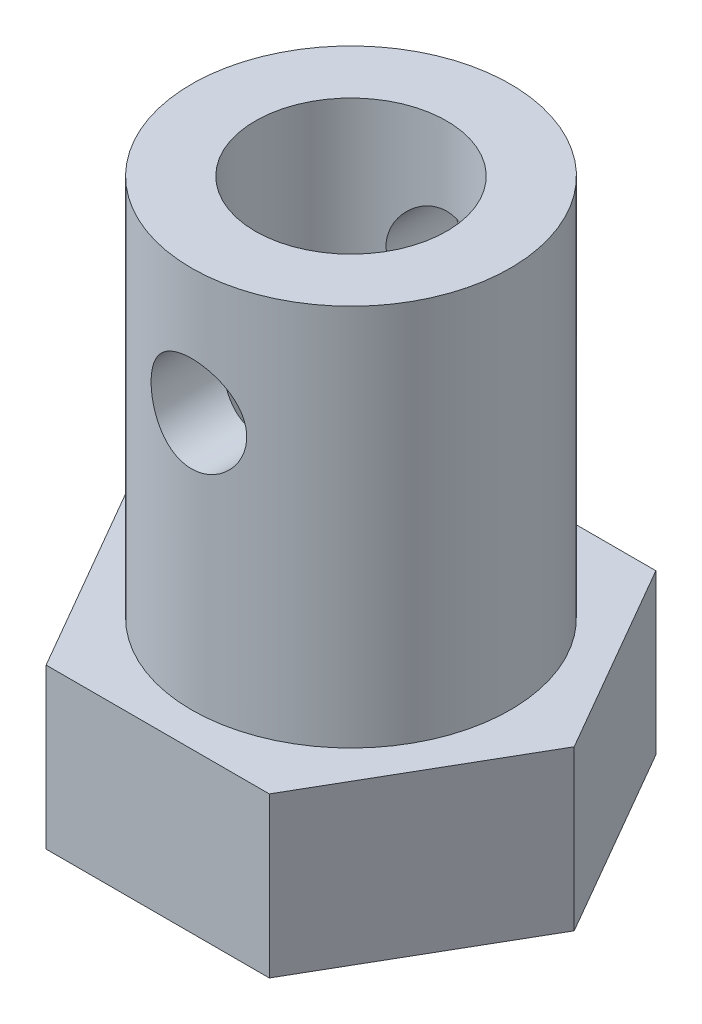
ISO-10303-21;
HEADER;
FILE_DESCRIPTION(('STEP AP214'),'2;1');
FILE_NAME('part.step','',(''),(''),'','','');
FILE_SCHEMA(('AUTOMOTIVE_DESIGN { 1 0 10303 214 1 1 1 1 }'));
ENDSEC;
DATA;
#1=APPLICATION_CONTEXT('core data for automotive mechanical design processes');
#2=APPLICATION_PROTOCOL_DEFINITION('international standard','automotive_design',2000,#1);
#3=PRODUCT_CONTEXT('',#1,'mechanical');
#4=PRODUCT('Part','Part','',(#3));
#5=PRODUCT_RELATED_PRODUCT_CATEGORY('part','',(#4));
#6=PRODUCT_DEFINITION_FORMATION('','',#4);
#7=PRODUCT_DEFINITION_CONTEXT('part definition',#1,'design');
#8=PRODUCT_DEFINITION('design','',#6,#7);
#9=PRODUCT_DEFINITION_SHAPE('','',#8);
#10=(LENGTH_UNIT() NAMED_UNIT(*) SI_UNIT(.MILLI.,.METRE.));
#11=(NAMED_UNIT(*) PLANE_ANGLE_UNIT() SI_UNIT($,.RADIAN.));
#12=(NAMED_UNIT(*) SI_UNIT($,.STERADIAN.) SOLID_ANGLE_UNIT());
#13=UNCERTAINTY_MEASURE_WITH_UNIT(LENGTH_MEASURE(1.E-05),#10,'distance_accuracy_value','');
#14=(GEOMETRIC_REPRESENTATION_CONTEXT(3) GLOBAL_UNCERTAINTY_ASSIGNED_CONTEXT((#13)) GLOBAL_UNIT_ASSIGNED_CONTEXT((#10,
#11,#12)) REPRESENTATION_CONTEXT('',''));
#15=CARTESIAN_POINT('',(0.,0.,0.));
#16=DIRECTION('',(0.,0.,1.));
#17=DIRECTION('',(1.,0.,0.));
#18=AXIS2_PLACEMENT_3D('',#15,#16,#17);
#19=CARTESIAN_POINT('',(0.,17.,0.));
#20=DIRECTION('',(0.,-1.,0.));
#21=DIRECTION('',(0.,0.,-1.));
#22=AXIS2_PLACEMENT_3D('',#19,#20,#21);
#23=CYLINDRICAL_SURFACE('',#22,5.);
#24=CARTESIAN_POINT('',(0.,5.,0.));
#25=DIRECTION('',(0.,1.,0.));
#26=DIRECTION('',(0.,0.,1.));
#27=AXIS2_PLACEMENT_3D('',#24,#25,#26);
#28=CIRCLE('',#27,5.);
#29=CARTESIAN_POINT('',(0.,5.,5.));
#30=VERTEX_POINT('',#29);
#31=EDGE_CURVE('E141',#30,#30,#28,.F.);
#32=ORIENTED_EDGE('',*,*,#31,.F.);
#33=EDGE_LOOP('',(#32));
#34=FACE_BOUND('',#33,.T.);
#35=CARTESIAN_POINT('',(0.,17.,0.));
#36=DIRECTION('',(0.,1.,0.));
#37=DIRECTION('',(0.,0.,1.));
#38=AXIS2_PLACEMENT_3D('',#35,#36,#37);
#39=CIRCLE('',#38,5.);
#40=CARTESIAN_POINT('',(0.,17.,5.));
#41=VERTEX_POINT('',#40);
#42=EDGE_CURVE('E236',#41,#41,#39,.T.);
#43=ORIENTED_EDGE('',*,*,#42,.F.);
#44=EDGE_LOOP('',(#43));
#45=FACE_BOUND('',#44,.T.);
#46=CARTESIAN_POINT('',(0.,14.5474637879701,-5.));
#47=CARTESIAN_POINT('',(0.0822886127533,14.5474627904852,-4.9999992925055));
#48=CARTESIAN_POINT('',(0.164587318351529,14.5406699243462,-4.99794915693954));
#49=CARTESIAN_POINT('',(0.326788125304881,14.513742433748,-4.98997105593691));
#50=CARTESIAN_POINT('',(0.40668950441142,14.4936038299468,-4.98404193389692));
#51=CARTESIAN_POINT('',(0.561732707754526,14.4407177710599,-4.96895552501836));
#52=CARTESIAN_POINT('',(0.636881364395373,14.4079889183512,-4.95980300250425));
#53=CARTESIAN_POINT('',(0.780624181053131,14.3309276949143,-4.93922109237645));
#54=CARTESIAN_POINT('',(0.849217467469669,14.2865937805747,-4.92779140192067));
#55=CARTESIAN_POINT('',(0.979871797183745,14.1862397804975,-4.90350737192774));
#56=CARTESIAN_POINT('',(1.04171807124434,14.1299471620842,-4.89062383657036));
#57=CARTESIAN_POINT('',(1.15524920923324,14.0078545580599,-4.86505834210442));
#58=CARTESIAN_POINT('',(1.20693236327441,13.9420529758452,-4.85237641724501));
#59=CARTESIAN_POINT('',(1.29980037723708,13.8009930349325,-4.82834113993772));
#60=CARTESIAN_POINT('',(1.34072309022213,13.7255553269794,-4.81702406663875));
#61=CARTESIAN_POINT('',(1.4092139477476,13.5684745337398,-4.79743620394031));
#62=CARTESIAN_POINT('',(1.43678529919973,13.4868329440421,-4.78916468313311));
#63=CARTESIAN_POINT('',(1.47701633682652,13.3220735218397,-4.77690870838434));
#64=CARTESIAN_POINT('',(1.49007196234677,13.2390610441062,-4.77281069324533));
#65=CARTESIAN_POINT('',(1.50213730614672,13.0719306317534,-4.76902789749767));
#66=CARTESIAN_POINT('',(1.50115042761078,12.987812969911,-4.76934204760571));
#67=CARTESIAN_POINT('',(1.48546977199812,12.8240798793616,-4.77424744067778));
#68=CARTESIAN_POINT('',(1.47127205262685,12.7444115376079,-4.7786838859914));
#69=CARTESIAN_POINT('',(1.43037420427056,12.5886440016967,-4.79108356228624));
#70=CARTESIAN_POINT('',(1.40367284141641,12.5125451605958,-4.79904714132351));
#71=CARTESIAN_POINT('',(1.33816026653682,12.3648634383094,-4.81772733074973));
#72=CARTESIAN_POINT('',(1.29918816934643,12.2933567040149,-4.82848016115952));
#73=CARTESIAN_POINT('',(1.21035222588683,12.1577317659599,-4.85150987000064));
#74=CARTESIAN_POINT('',(1.16048574002588,12.0936153585563,-4.86378711746991));
#75=CARTESIAN_POINT('',(1.04881290765546,11.9717775972081,-4.88911011297937));
#76=CARTESIAN_POINT('',(0.986594907466973,11.9144351239405,-4.90216654310498));
#77=CARTESIAN_POINT('',(0.853263259313968,11.8109098039059,-4.92712244063259));
#78=CARTESIAN_POINT('',(0.782149051860889,11.7647276595557,-4.9390218351841));
#79=CARTESIAN_POINT('',(0.632355038342804,11.6846038655054,-4.9604316006947));
#80=CARTESIAN_POINT('',(0.553627749747951,11.6507462717203,-4.96992543668314));
#81=CARTESIAN_POINT('',(0.39124541560352,11.5968641978705,-4.98533521832222));
#82=CARTESIAN_POINT('',(0.307591751589583,11.5768358594376,-4.99125216186999));
#83=CARTESIAN_POINT('',(0.140952242668333,11.5518116100707,-4.99868364643538));
#84=CARTESIAN_POINT('',(0.0580500976011878,11.5463022021685,-5.0003485041779));
#85=CARTESIAN_POINT('',(-0.107499605823382,11.5490329436822,-4.9995292324176));
#86=CARTESIAN_POINT('',(-0.19014719669078,11.5572712576216,-4.99704565677756));
#87=CARTESIAN_POINT('',(-0.350903605309696,11.5868483990816,-4.98830696987163));
#88=CARTESIAN_POINT('',(-0.429072772614168,11.607887175551,-4.98213829799417));
#89=CARTESIAN_POINT('',(-0.580754638954521,11.6621070207483,-4.96674347841533));
#90=CARTESIAN_POINT('',(-0.654266777025583,11.695289549008,-4.95751696321085));
#91=CARTESIAN_POINT('',(-0.796437189461051,11.7737169534513,-4.93669654351325));
#92=CARTESIAN_POINT('',(-0.864943826199669,11.8192231289181,-4.92505280829675));
#93=CARTESIAN_POINT('',(-0.993523307980146,11.9206885420229,-4.90073468764318));
#94=CARTESIAN_POINT('',(-1.05359403235593,11.9766503998578,-4.8880600443108));
#95=CARTESIAN_POINT('',(-1.16585744551027,12.0998510963395,-4.86253171869138));
#96=CARTESIAN_POINT('',(-1.21768481231503,12.1674256637419,-4.84968825033268));
#97=CARTESIAN_POINT('',(-1.30928995072153,12.3105917269837,-4.82576515238463));
#98=CARTESIAN_POINT('',(-1.34906803829472,12.3861830125283,-4.81468547654651));
#99=CARTESIAN_POINT('',(-1.41517347127168,12.5429962792248,-4.79567189615055));
#100=CARTESIAN_POINT('',(-1.4415634693705,12.6241899745067,-4.78772337843827));
#101=CARTESIAN_POINT('',(-1.48021730815114,12.7901517569016,-4.77591594362794));
#102=CARTESIAN_POINT('',(-1.49248598978779,12.8749186087578,-4.772055625083));
#103=CARTESIAN_POINT('',(-1.50221984485059,13.0418253063463,-4.76899972496087));
#104=CARTESIAN_POINT('',(-1.5002805530849,13.1239274389877,-4.76961647442755));
#105=CARTESIAN_POINT('',(-1.48307505444813,13.2865778913429,-4.77499401288294));
#106=CARTESIAN_POINT('',(-1.46780938124716,13.3671262731465,-4.77975463592551));
#107=CARTESIAN_POINT('',(-1.42476888804136,13.523409187113,-4.79275763670385));
#108=CARTESIAN_POINT('',(-1.39715175507068,13.5991910753318,-4.80095604545965));
#109=CARTESIAN_POINT('',(-1.33031507121129,13.7451062267878,-4.81990278909136));
#110=CARTESIAN_POINT('',(-1.29109329962876,13.8152384056109,-4.83065161194312));
#111=CARTESIAN_POINT('',(-1.20048763805072,13.9506269044972,-4.85397676425833));
#112=CARTESIAN_POINT('',(-1.14871276092994,14.0156125492305,-4.86660540163798));
#113=CARTESIAN_POINT('',(-1.03517434629782,14.136166286278,-4.89201320450026));
#114=CARTESIAN_POINT('',(-0.973408217134501,14.1917319274379,-4.90479240823905));
#115=CARTESIAN_POINT('',(-0.839465762183249,14.2934872002652,-4.92950936570649));
#116=CARTESIAN_POINT('',(-0.767037885790609,14.3393552348256,-4.94141159765674));
#117=CARTESIAN_POINT('',(-0.615141373983531,14.4181989578741,-4.96260680455813));
#118=CARTESIAN_POINT('',(-0.535676052998956,14.4511806762446,-4.97190099931067));
#119=CARTESIAN_POINT('',(-0.380757712655282,14.5003590636229,-4.98602174969301));
#120=CARTESIAN_POINT('',(-0.305786961954235,14.5179754608534,-4.99122027381068));
#121=CARTESIAN_POINT('',(-0.153880195230779,14.5415273132117,-4.99820944494492));
#122=CARTESIAN_POINT('',(-0.0769445098581395,14.5474647206749,-5.0000006615474));
#123=CARTESIAN_POINT('',(0.,14.5474637879701,-5.));
#124=B_SPLINE_CURVE_WITH_KNOTS('',3,(#46,#47,#48,#49,#50,#51,#52,#53,#54,#55,#56,#57,#58,#59,
#60,#61,#62,#63,#64,#65,#66,#67,#68,#69,#70,#71,#72,#73,#74,#75,#76,#77,#78,#79,#80,#81,#82,#83,
#84,#85,#86,#87,#88,#89,#90,#91,#92,#93,#94,#95,#96,#97,#98,#99,#100,#101,#102,#103,#104,#105,
#106,#107,#108,#109,#110,#111,#112,#113,#114,#115,#116,#117,#118,#119,#120,#121,#122,#123),
.UNSPECIFIED.,.T.,.F.,(4,2,2,2,2,2,2,2,2,2,2,2,2,2,2,2,2,2,2,2,2,2,2,2,2,2,2,2,2,2,2,2,2,2,2,2,
2,2,4),(0.,0.246583203612611,0.493239964845999,0.739533676300874,0.985860164412702,
1.23855602948191,1.49129437288633,1.74971481004109,2.00807314543223,2.25919689356599,
2.51025978319089,2.75226016697676,2.99428443658001,3.23962426447119,3.48502360158555,
3.74067104048166,3.99633456531071,4.25371046881688,4.51101453528807,4.75908809438545,
5.00712853550326,5.24956746682327,5.49203554593728,5.74011305702908,5.98825282000191,
6.24540400322818,6.5025484425268,6.75847814951251,7.01432009460282,7.25950155466943,
7.504673196616,7.74680040402721,7.98897397553107,8.2399692567993,8.49102974897502,
8.7494299615667,9.00770911595235,9.23831691930459,9.46888616948874),.UNSPECIFIED.);
#125=CARTESIAN_POINT('',(0.,14.5474637879701,-5.));
#126=VERTEX_POINT('',#125);
#127=EDGE_CURVE('E188',#126,#126,#124,.T.);
#128=ORIENTED_EDGE('',*,*,#127,.F.);
#129=EDGE_LOOP('',(#128));
#130=FACE_BOUND('',#129,.T.);
#131=CARTESIAN_POINT('',(0.,11.5474637879701,5.00000000000001));
#132=CARTESIAN_POINT('',(0.0822886127532998,11.547464785455,4.9999992925055));
#133=CARTESIAN_POINT('',(0.164587318351529,11.5542576515941,4.99794915693954));
#134=CARTESIAN_POINT('',(0.32678812530488,11.5811851421922,4.98997105593691));
#135=CARTESIAN_POINT('',(0.406689504411419,11.6013237459935,4.98404193389692));
#136=CARTESIAN_POINT('',(0.561732707754525,11.6542098048804,4.96895552501836));
#137=CARTESIAN_POINT('',(0.636881364395371,11.6869386575891,4.95980300250425));
#138=CARTESIAN_POINT('',(0.780624181053129,11.763999881026,4.93922109237645));
#139=CARTESIAN_POINT('',(0.849217467469667,11.8083337953655,4.92779140192067));
#140=CARTESIAN_POINT('',(0.979871797183744,11.9086877954428,4.90350737192774));
#141=CARTESIAN_POINT('',(1.04171807124434,11.964980413856,4.89062383657036));
#142=CARTESIAN_POINT('',(1.15524920923324,12.0870730178803,4.86505834210442));
#143=CARTESIAN_POINT('',(1.20693236327441,12.1528746000951,4.85237641724501));
#144=CARTESIAN_POINT('',(1.29980037723708,12.2939345410077,4.82834113993772));
#145=CARTESIAN_POINT('',(1.34072309022213,12.3693722489609,4.81702406663875));
#146=CARTESIAN_POINT('',(1.4092139477476,12.5264530422004,4.79743620394031));
#147=CARTESIAN_POINT('',(1.43678529919973,12.6080946318981,4.78916468313311));
#148=CARTESIAN_POINT('',(1.47701633682652,12.7728540541006,4.77690870838434));
#149=CARTESIAN_POINT('',(1.49007196234677,12.8558665318341,4.77281069324533));
#150=CARTESIAN_POINT('',(1.50213730614672,13.0229969441869,4.76902789749767));
#151=CARTESIAN_POINT('',(1.50115042761078,13.1071146060292,4.76934204760571));
#152=CARTESIAN_POINT('',(1.48546977199812,13.2708476965786,4.77424744067778));
#153=CARTESIAN_POINT('',(1.47127205262685,13.3505160383324,4.7786838859914));
#154=CARTESIAN_POINT('',(1.43037420427056,13.5062835742436,4.79108356228624));
#155=CARTESIAN_POINT('',(1.40367284141641,13.5823824153445,4.79904714132351));
#156=CARTESIAN_POINT('',(1.33816026653682,13.7300641376309,4.81772733074973));
#157=CARTESIAN_POINT('',(1.29918816934643,13.8015708719254,4.82848016115952));
#158=CARTESIAN_POINT('',(1.21035222588683,13.9371958099803,4.85150987000064));
#159=CARTESIAN_POINT('',(1.16048574002589,14.0013122173839,4.86378711746991));
#160=CARTESIAN_POINT('',(1.04881290765547,14.1231499787321,4.88911011297937));
#161=CARTESIAN_POINT('',(0.986594907466974,14.1804924519998,4.90216654310498));
#162=CARTESIAN_POINT('',(0.853263259313969,14.2840177720344,4.92712244063258));
#163=CARTESIAN_POINT('',(0.782149051860889,14.3301999163845,4.9390218351841));
#164=CARTESIAN_POINT('',(0.632355038342804,14.4103237104349,4.9604316006947));
#165=CARTESIAN_POINT('',(0.553627749747951,14.44418130422,4.96992543668314));
#166=CARTESIAN_POINT('',(0.391245415603521,14.4980633780698,4.98533521832222));
#167=CARTESIAN_POINT('',(0.307591751589583,14.5180917165026,4.99125216186999));
#168=CARTESIAN_POINT('',(0.140952242668333,14.5431159658695,4.99868364643538));
#169=CARTESIAN_POINT('',(0.0580500976011886,14.5486253737717,5.0003485041779));
#170=CARTESIAN_POINT('',(-0.107499605823381,14.545894632258,4.9995292324176));
#171=CARTESIAN_POINT('',(-0.190147196690779,14.5376563183187,4.99704565677756));
#172=CARTESIAN_POINT('',(-0.350903605309695,14.5080791768586,4.98830696987163));
#173=CARTESIAN_POINT('',(-0.429072772614167,14.4870404003893,4.98213829799417));
#174=CARTESIAN_POINT('',(-0.58075463895452,14.4328205551919,4.96674347841533));
#175=CARTESIAN_POINT('',(-0.654266777025582,14.3996380269323,4.95751696321085));
#176=CARTESIAN_POINT('',(-0.79643718946105,14.321210622489,4.93669654351325));
#177=CARTESIAN_POINT('',(-0.864943826199667,14.2757044470222,4.92505280829675));
#178=CARTESIAN_POINT('',(-0.993523307980145,14.1742390339173,4.90073468764318));
#179=CARTESIAN_POINT('',(-1.05359403235593,14.1182771760825,4.8880600443108));
#180=CARTESIAN_POINT('',(-1.16585744551027,13.9950764796008,4.86253171869138));
#181=CARTESIAN_POINT('',(-1.21768481231503,13.9275019121984,4.84968825033268));
#182=CARTESIAN_POINT('',(-1.30928995072153,13.7843358489566,4.82576515238463));
#183=CARTESIAN_POINT('',(-1.34906803829472,13.7087445634119,4.81468547654651));
#184=CARTESIAN_POINT('',(-1.41517347127168,13.5519312967154,4.79567189615055));
#185=CARTESIAN_POINT('',(-1.4415634693705,13.4707376014335,4.78772337843827));
#186=CARTESIAN_POINT('',(-1.48021730815114,13.3047758190386,4.77591594362794));
#187=CARTESIAN_POINT('',(-1.49248598978779,13.2200089671825,4.772055625083));
#188=CARTESIAN_POINT('',(-1.50221984485059,13.0531022695939,4.76899972496087));
#189=CARTESIAN_POINT('',(-1.5002805530849,12.9710001369525,4.76961647442755));
#190=CARTESIAN_POINT('',(-1.48307505444813,12.8083496845973,4.77499401288294));
#191=CARTESIAN_POINT('',(-1.46780938124716,12.7278013027938,4.77975463592551));
#192=CARTESIAN_POINT('',(-1.42476888804136,12.5715183888273,4.79275763670385));
#193=CARTESIAN_POINT('',(-1.39715175507068,12.4957365006084,4.80095604545965));
#194=CARTESIAN_POINT('',(-1.33031507121129,12.3498213491524,4.81990278909136));
#195=CARTESIAN_POINT('',(-1.29109329962876,12.2796891703294,4.83065161194312));
#196=CARTESIAN_POINT('',(-1.20048763805072,12.144300671443,4.85397676425833));
#197=CARTESIAN_POINT('',(-1.14871276092994,12.0793150267097,4.86660540163798));
#198=CARTESIAN_POINT('',(-1.03517434629782,11.9587612896623,4.89201320450026));
#199=CARTESIAN_POINT('',(-0.973408217134501,11.9031956485024,4.90479240823905));
#200=CARTESIAN_POINT('',(-0.839465762183249,11.8014403756751,4.92950936570649));
#201=CARTESIAN_POINT('',(-0.767037885790609,11.7555723411146,4.94141159765674));
#202=CARTESIAN_POINT('',(-0.615141373983531,11.6767286180661,4.96260680455813));
#203=CARTESIAN_POINT('',(-0.535676052998957,11.6437468996956,4.97190099931067));
#204=CARTESIAN_POINT('',(-0.380757712655282,11.5945685123174,4.98602174969301));
#205=CARTESIAN_POINT('',(-0.305786961954235,11.5769521150869,4.99122027381067));
#206=CARTESIAN_POINT('',(-0.153880195230779,11.5534002627285,4.99820944494492));
#207=CARTESIAN_POINT('',(-0.0769445098581395,11.5474628552653,5.00000066154741));
#208=CARTESIAN_POINT('',(0.,11.5474637879701,5.00000000000001));
#209=B_SPLINE_CURVE_WITH_KNOTS('',3,(#131,#132,#133,#134,#135,#136,#137,#138,#139,#140,#141,
#142,#143,#144,#145,#146,#147,#148,#149,#150,#151,#152,#153,#154,#155,#156,#157,#158,#159,#160,
#161,#162,#163,#164,#165,#166,#167,#168,#169,#170,#171,#172,#173,#174,#175,#176,#177,#178,#179,
#180,#181,#182,#183,#184,#185,#186,#187,#188,#189,#190,#191,#192,#193,#194,#195,#196,#197,#198,
#199,#200,#201,#202,#203,#204,#205,#206,#207,#208),.UNSPECIFIED.,.T.,.F.,(4,2,2,2,2,2,2,2,2,2,2,
2,2,2,2,2,2,2,2,2,2,2,2,2,2,2,2,2,2,2,2,2,2,2,2,2,2,2,4),(0.,0.24658320361261,0.493239964845999,
0.739533676300871,0.9858601644127,1.23855602948191,1.49129437288633,1.74971481004109,
2.00807314543223,2.25919689356599,2.51025978319089,2.75226016697676,2.99428443658001,
3.23962426447119,3.48502360158555,3.74067104048166,3.99633456531071,4.25371046881688,
4.51101453528808,4.75908809438545,5.00712853550327,5.24956746682327,5.49203554593728,
5.74011305702908,5.98825282000191,6.24540400322818,6.5025484425268,6.75847814951252,
7.01432009460283,7.25950155466943,7.504673196616,7.74680040402721,7.98897397553107,
8.23996925679931,8.49102974897502,8.74942996156671,9.00770911595235,9.2383169193046,
9.46888616948875),.UNSPECIFIED.);
#210=CARTESIAN_POINT('',(0.,11.5474637879701,5.00000000000001));
#211=VERTEX_POINT('',#210);
#212=EDGE_CURVE('E181',#211,#211,#209,.T.);
#213=ORIENTED_EDGE('',*,*,#212,.F.);
#214=EDGE_LOOP('',(#213));
#215=FACE_BOUND('',#214,.T.);
#216=ADVANCED_FACE('F39',(#34,#45,#130,#215),#23,.T.);
#217=CARTESIAN_POINT('',(0.,17.,0.));
#218=DIRECTION('',(0.,-1.,0.));
#219=DIRECTION('',(0.,0.,-1.));
#220=AXIS2_PLACEMENT_3D('',#217,#218,#219);
#221=CYLINDRICAL_SURFACE('',#220,3.);
#222=CARTESIAN_POINT('',(-1.5,13.0474637879701,2.59807621135332));
#223=CARTESIAN_POINT('',(-1.4999945446118,12.9693020756772,2.59808302092689));
#224=CARTESIAN_POINT('',(-1.49384995609983,12.8910416706826,2.60165701781635));
#225=CARTESIAN_POINT('',(-1.46958481484708,12.7369228909544,2.61543549678079));
#226=CARTESIAN_POINT('',(-1.45143909683127,12.661069915405,2.62565391083339));
#227=CARTESIAN_POINT('',(-1.40414992304972,12.5142862914542,2.65124019908098));
#228=CARTESIAN_POINT('',(-1.3750649287406,12.4433318092597,2.66658065209878));
#229=CARTESIAN_POINT('',(-1.30690128806456,12.307327484975,2.70063997225287));
#230=CARTESIAN_POINT('',(-1.26782210105366,12.2422779625764,2.71935902214097));
#231=CARTESIAN_POINT('',(-1.17699981079632,12.1140051951339,2.75995303586162));
#232=CARTESIAN_POINT('',(-1.12447805421566,12.0513750844598,2.7819609545693));
#233=CARTESIAN_POINT('',(-1.0098807114217,11.9353512053601,2.82557974178559));
#234=CARTESIAN_POINT('',(-0.94780038867344,11.8819620440948,2.84719040746875));
#235=CARTESIAN_POINT('',(-0.81073434512182,11.7824130612486,2.88932215429424));
#236=CARTESIAN_POINT('',(-0.735160783518864,11.7369831361808,2.90967159627259));
#237=CARTESIAN_POINT('',(-0.576235539899257,11.6597525081015,2.94526134149293));
#238=CARTESIAN_POINT('',(-0.492888807207234,11.6279432037644,2.96050486775612));
#239=CARTESIAN_POINT('',(-0.327067415888967,11.5812067960185,2.98320691866356));
#240=CARTESIAN_POINT('',(-0.244952685733227,11.5652394984368,2.99114220331338));
#241=CARTESIAN_POINT('',(-0.0788559430467731,11.5472146099576,3.00011375769101));
#242=CARTESIAN_POINT('',(0.00512490876560694,11.5451486027766,3.00115420176885));
#243=CARTESIAN_POINT('',(0.164748786635624,11.5545837989256,2.99644472874675));
#244=CARTESIAN_POINT('',(0.240481798765187,11.564920811252,2.99127743838241));
#245=CARTESIAN_POINT('',(0.388970657877483,11.5967850538271,2.97561367889621));
#246=CARTESIAN_POINT('',(0.461726281640888,11.6183131214345,2.96511681099591));
#247=CARTESIAN_POINT('',(0.60346408735433,11.6720876371048,2.93957374931482));
#248=CARTESIAN_POINT('',(0.672380135272767,11.7044782577282,2.92446662293799));
#249=CARTESIAN_POINT('',(0.803965202269993,11.7788589122724,2.89106468980031));
#250=CARTESIAN_POINT('',(0.866631973257968,11.8208523829236,2.87276874236226));
#251=CARTESIAN_POINT('',(0.990260491347292,11.9178068152696,2.83266591598844));
#252=CARTESIAN_POINT('',(1.05050111254404,11.9736183304591,2.81069063997263));
#253=CARTESIAN_POINT('',(1.16115655544667,12.0943483753654,2.76681510880218));
#254=CARTESIAN_POINT('',(1.21156381736135,12.1592738463812,2.74491492398443));
#255=CARTESIAN_POINT('',(1.30425800196332,12.3014360766063,2.70216234138727));
#256=CARTESIAN_POINT('',(1.34582597246708,12.3791928225514,2.68146479986061));
#257=CARTESIAN_POINT('',(1.41497866950185,12.5418702950086,2.64563175417864));
#258=CARTESIAN_POINT('',(1.44257798731633,12.6267834374965,2.63049045069101));
#259=CARTESIAN_POINT('',(1.48077031653756,12.7942855548943,2.60916953725552));
#260=CARTESIAN_POINT('',(1.49253768317996,12.8765254665354,2.60237483772745));
#261=CARTESIAN_POINT('',(1.50227541991714,13.0420658002449,2.59676879042414));
#262=CARTESIAN_POINT('',(1.50025553597254,13.1253654316498,2.59795180333967));
#263=CARTESIAN_POINT('',(1.48355406501595,13.2809446658382,2.60751504810877));
#264=CARTESIAN_POINT('',(1.4702817250687,13.353432964632,2.61509381259981));
#265=CARTESIAN_POINT('',(1.43354442694866,13.4950154673766,2.63541032327012));
#266=CARTESIAN_POINT('',(1.41007616793542,13.56410856409,2.64814974007551));
#267=CARTESIAN_POINT('',(1.35247138290733,13.7005807843242,2.67804333119485));
#268=CARTESIAN_POINT('',(1.31789109553909,13.7677323132505,2.69537464864595));
#269=CARTESIAN_POINT('',(1.23943059602371,13.8956676952786,2.73234179245875));
#270=CARTESIAN_POINT('',(1.19554560649832,13.95644825324,2.75197880032721));
#271=CARTESIAN_POINT('',(1.09325575079828,14.0779319392554,2.79431997684504));
#272=CARTESIAN_POINT('',(1.03371790847245,14.1376595140466,2.81709874731434));
#273=CARTESIAN_POINT('',(0.905106743097433,14.2465821449605,2.86101352466839));
#274=CARTESIAN_POINT('',(0.836030211983021,14.2957736433159,2.88214897511564));
#275=CARTESIAN_POINT('',(0.687803043838137,14.3833243768953,2.92112042536435));
#276=CARTESIAN_POINT('',(0.608434646361171,14.4213634652865,2.93885462508044));
#277=CARTESIAN_POINT('',(0.443283546961624,14.4831706437562,2.96825032438951));
#278=CARTESIAN_POINT('',(0.357506552088265,14.5069512650196,2.97991715514559));
#279=CARTESIAN_POINT('',(0.190469523495627,14.5375166342321,2.99501262272824));
#280=CARTESIAN_POINT('',(0.109517165775687,14.5456606017843,2.99909891862287));
#281=CARTESIAN_POINT('',(-0.0526889789268044,14.5487286861517,3.00063195562697));
#282=CARTESIAN_POINT('',(-0.133942650442629,14.5436574307555,2.99808102100335));
#283=CARTESIAN_POINT('',(-0.28880698847572,14.5213391777767,2.98700953256884));
#284=CARTESIAN_POINT('',(-0.362568476716895,14.5049165140836,2.97889342001985));
#285=CARTESIAN_POINT('',(-0.506168928275426,14.4614732890157,2.95788140495135));
#286=CARTESIAN_POINT('',(-0.576007327433262,14.4344512078299,2.94498481699194));
#287=CARTESIAN_POINT('',(-0.713135109367327,14.3693732097212,2.9148889612218));
#288=CARTESIAN_POINT('',(-0.780187714050069,14.3308948031584,2.89752925798199));
#289=CARTESIAN_POINT('',(-0.907161962721037,14.2445268916815,2.86032199712739));
#290=CARTESIAN_POINT('',(-0.96708031112236,14.1966330642966,2.84047329837541));
#291=CARTESIAN_POINT('',(-1.08437100623534,14.0872680794361,2.79792915339941));
#292=CARTESIAN_POINT('',(-1.14089652680891,14.0249200567543,2.77514698517547));
#293=CARTESIAN_POINT('',(-1.24299493109201,13.8912877062755,2.73094614244279));
#294=CARTESIAN_POINT('',(-1.28855812501509,13.8199955566686,2.70952868642798));
#295=CARTESIAN_POINT('',(-1.36864661967848,13.6675088180987,2.66999407957374));
#296=CARTESIAN_POINT('',(-1.40277759894141,13.586072491277,2.65200261384405));
#297=CARTESIAN_POINT('',(-1.45631806425962,13.4174651814605,2.62299234492527));
#298=CARTESIAN_POINT('',(-1.47577678676302,13.3303144546011,2.61195024221553));
#299=CARTESIAN_POINT('',(-1.49155051179662,13.2097557544921,2.60293908902686));
#300=CARTESIAN_POINT('',(-1.49471415744578,13.1774119463733,2.60112193507728));
#301=CARTESIAN_POINT('',(-1.49894010763494,13.1125390669468,2.59868903831625));
#302=CARTESIAN_POINT('',(-1.50000227159981,13.0800099833913,2.59807337587664));
#303=CARTESIAN_POINT('',(-1.5,13.0474637879701,2.59807621135332));
#304=B_SPLINE_CURVE_WITH_KNOTS('',3,(#222,#223,#224,#225,#226,#227,#228,#229,#230,#231,#232,
#233,#234,#235,#236,#237,#238,#239,#240,#241,#242,#243,#244,#245,#246,#247,#248,#249,#250,#251,
#252,#253,#254,#255,#256,#257,#258,#259,#260,#261,#262,#263,#264,#265,#266,#267,#268,#269,#270,
#271,#272,#273,#274,#275,#276,#277,#278,#279,#280,#281,#282,#283,#284,#285,#286,#287,#288,#289,
#290,#291,#292,#293,#294,#295,#296,#297,#298,#299,#300,#301,#302,#303),.UNSPECIFIED.,.T.,.F.,(4,
2,2,2,2,2,2,2,2,2,2,2,2,2,2,2,2,2,2,2,2,2,2,2,2,2,2,2,2,2,2,2,2,2,2,2,2,2,2,2,4),(0.,
0.234348183892073,0.469189339237207,0.702792893878329,0.936409088167725,1.18929346874735,
1.44230356626556,1.71236838358145,1.98226240445836,2.23295227451903,2.4834903552906,
2.71224146226807,2.94100968776183,3.1729430209672,3.40495949025408,3.65890787185336,
3.91305072368878,4.18333262594173,4.45333161317557,4.70193436281318,4.95036139782559,
5.17161275136038,5.39293578654094,5.62450944609131,5.85620229330071,6.1171011537092,
6.37808797467303,6.64596272119448,6.91360169713157,7.1566840558423,7.39968130190957,
7.62666637307239,7.85368400268019,8.09041126079208,8.32724745151078,8.58765362775101,
8.84828914267731,9.11716123557907,9.3851269950414,9.48270202777964,9.58028358741811),.UNSPECIFIED.);
#305=CARTESIAN_POINT('',(-1.5,13.0474637879701,2.59807621135332));
#306=VERTEX_POINT('',#305);
#307=EDGE_CURVE('E162',#306,#306,#304,.T.);
#308=ORIENTED_EDGE('',*,*,#307,.T.);
#309=EDGE_LOOP('',(#308));
#310=FACE_BOUND('',#309,.T.);
#311=CARTESIAN_POINT('',(0.,17.,0.));
#312=DIRECTION('',(0.,1.,0.));
#313=DIRECTION('',(0.,0.,1.));
#314=AXIS2_PLACEMENT_3D('',#311,#312,#313);
#315=CIRCLE('',#314,3.);
#316=CARTESIAN_POINT('',(0.,17.,3.));
#317=VERTEX_POINT('',#316);
#318=EDGE_CURVE('E240',#317,#317,#315,.T.);
#319=ORIENTED_EDGE('',*,*,#318,.T.);
#320=EDGE_LOOP('',(#319));
#321=FACE_BOUND('',#320,.T.);
#322=CARTESIAN_POINT('',(0.,0.,0.));
#323=DIRECTION('',(0.,1.,0.));
#324=DIRECTION('',(0.,0.,1.));
#325=AXIS2_PLACEMENT_3D('',#322,#323,#324);
#326=CIRCLE('',#325,3.);
#327=CARTESIAN_POINT('',(0.,0.,3.));
#328=VERTEX_POINT('',#327);
#329=EDGE_CURVE('E241',#328,#328,#326,.T.);
#330=ORIENTED_EDGE('',*,*,#329,.F.);
#331=EDGE_LOOP('',(#330));
#332=FACE_BOUND('',#331,.T.);
#333=CARTESIAN_POINT('',(0.,14.5474637879701,-3.));
#334=CARTESIAN_POINT('',(0.0788579444268501,14.5474588344943,-2.99999570107562));
#335=CARTESIAN_POINT('',(0.157809899546344,14.5412086782885,-2.99685736529635));
#336=CARTESIAN_POINT('',(0.313380352903344,14.5164844674578,-2.98461234055736));
#337=CARTESIAN_POINT('',(0.389994130070444,14.4979871984734,-2.97549431743379));
#338=CARTESIAN_POINT('',(0.538400317320673,14.4496730750452,-2.95224419105063));
#339=CARTESIAN_POINT('',(0.610210204408719,14.4199002115982,-2.93813158766306));
#340=CARTESIAN_POINT('',(0.747708925209898,14.3501078559226,-2.90618664773642));
#341=CARTESIAN_POINT('',(0.813398240985089,14.3100891715968,-2.88835460450288));
#342=CARTESIAN_POINT('',(0.941261726642864,14.2181879137422,-2.84934387387093));
#343=CARTESIAN_POINT('',(1.00298281668316,14.1657340691107,-2.82802798691306));
#344=CARTESIAN_POINT('',(1.11716916730047,14.0516815690996,-2.78489955370115));
#345=CARTESIAN_POINT('',(1.16962737466015,13.9900760103115,-2.76308664313552));
#346=CARTESIAN_POINT('',(1.26787800067542,13.8537387636851,-2.71948426796021));
#347=CARTESIAN_POINT('',(1.31283800332746,13.7783596404513,-2.69782780455198));
#348=CARTESIAN_POINT('',(1.38925234033604,13.6199127839908,-2.65928968158481));
#349=CARTESIAN_POINT('',(1.4207163224495,13.536850594886,-2.64240461410484));
#350=CARTESIAN_POINT('',(1.46719866328288,13.3704661298372,-2.61686800556713));
#351=CARTESIAN_POINT('',(1.48308878562066,13.287457109869,-2.6077840737557));
#352=CARTESIAN_POINT('',(1.50064048996327,13.1194955313009,-2.59772834922792));
#353=CARTESIAN_POINT('',(1.50231613255961,13.0345449766634,-2.59674854014932));
#354=CARTESIAN_POINT('',(1.49203093075844,12.8760347514971,-2.60266395385873));
#355=CARTESIAN_POINT('',(1.48167683930523,12.8023277411355,-2.6086314549302));
#356=CARTESIAN_POINT('',(1.4504097735854,12.6578809239106,-2.62614343100775));
#357=CARTESIAN_POINT('',(1.42949343584648,12.5871420700121,-2.63768968247664));
#358=CARTESIAN_POINT('',(1.37731467057901,12.4486200891216,-2.66531214619112));
#359=CARTESIAN_POINT('',(1.34582260067399,12.3809441897914,-2.68148760995998));
#360=CARTESIAN_POINT('',(1.273562531502,12.2515123490851,-2.71655106422106));
#361=CARTESIAN_POINT('',(1.2327903657187,12.18975908457,-2.73544027170286));
#362=CARTESIAN_POINT('',(1.13709908236918,12.0656819088553,-2.77669736854929));
#363=CARTESIAN_POINT('',(1.08104168755392,12.0042784776059,-2.79920265355119));
#364=CARTESIAN_POINT('',(0.959333368112061,11.8913606600838,-2.84321434950611));
#365=CARTESIAN_POINT('',(0.893677884861429,11.8398509999193,-2.86472027938201));
#366=CARTESIAN_POINT('',(0.750774758747773,11.7459352964255,-2.90552980924446));
#367=CARTESIAN_POINT('',(0.673130387399114,11.7040630793015,-2.92468476243011));
#368=CARTESIAN_POINT('',(0.510699323233196,11.6343182444056,-2.95736821681863));
#369=CARTESIAN_POINT('',(0.425918364397915,11.6064345104474,-2.9709011841533));
#370=CARTESIAN_POINT('',(0.259149737491054,11.5677506823951,-2.98986500612153));
#371=CARTESIAN_POINT('',(0.17751229582249,11.5557269343499,-2.99587407451965));
#372=CARTESIAN_POINT('',(0.0131693999240278,11.5452666912684,-3.00109520188655));
#373=CARTESIAN_POINT('',(-0.0695355298048628,11.5468237595109,-3.00031048081978));
#374=CARTESIAN_POINT('',(-0.22684945797898,11.5627738205982,-2.99236788380152));
#375=CARTESIAN_POINT('',(-0.301589112074895,11.5761625870651,-2.98570868532253));
#376=CARTESIAN_POINT('',(-0.447610338452911,11.6138208958128,-2.9673325697226));
#377=CARTESIAN_POINT('',(-0.51889152853663,11.6380916376504,-2.95561509501618));
#378=CARTESIAN_POINT('',(-0.658332912674359,11.6974614876197,-2.92776377120382));
#379=CARTESIAN_POINT('',(-0.726345595508705,11.7328503631446,-2.91151322654446));
#380=CARTESIAN_POINT('',(-0.855692042548907,11.81312509144,-2.87615961476126));
#381=CARTESIAN_POINT('',(-0.917022944664887,11.8580149898632,-2.85705533350407));
#382=CARTESIAN_POINT('',(-1.03765153393382,11.9611044259662,-2.81562332004297));
#383=CARTESIAN_POINT('',(-1.09615811672854,12.0201780906378,-2.79316327265249));
#384=CARTESIAN_POINT('',(-1.20278448167828,12.1473515148867,-2.7489358741323));
#385=CARTESIAN_POINT('',(-1.25089707856781,12.215457466242,-2.72716901100071));
#386=CARTESIAN_POINT('',(-1.33756187171853,12.3629292692296,-2.68576788309734));
#387=CARTESIAN_POINT('',(-1.37553824370037,12.4426806871118,-2.66628794383591));
#388=CARTESIAN_POINT('',(-1.43712423890206,12.6087288893326,-2.63361108441202));
#389=CARTESIAN_POINT('',(-1.46075237380052,12.6950170776705,-2.62040607332625));
#390=CARTESIAN_POINT('',(-1.49079253120031,12.8628291222972,-2.60342251538703));
#391=CARTESIAN_POINT('',(-1.49863949460818,12.944015168123,-2.59886075197597));
#392=CARTESIAN_POINT('',(-1.5010337315643,13.1066343887169,-2.59748031962405));
#393=CARTESIAN_POINT('',(-1.49558676993486,13.1880674410769,-2.60065829439585));
#394=CARTESIAN_POINT('',(-1.47288918838996,13.3406890402703,-2.61356793076615));
#395=CARTESIAN_POINT('',(-1.45681247151455,13.4121144931872,-2.62264641723988));
#396=CARTESIAN_POINT('',(-1.41476303733662,13.5511759671067,-2.64556524281479));
#397=CARTESIAN_POINT('',(-1.38878713673988,13.6188107611082,-2.65940711354503));
#398=CARTESIAN_POINT('',(-1.32572361795085,13.7534010644499,-2.69142795546804));
#399=CARTESIAN_POINT('',(-1.28800670672355,13.8200056407137,-2.70983583593881));
#400=CARTESIAN_POINT('',(-1.20322645745609,13.946375592242,-2.74852997452291));
#401=CARTESIAN_POINT('',(-1.15615825686234,14.0061373837518,-2.76881720693416));
#402=CARTESIAN_POINT('',(-1.04730498999206,14.1246767615021,-2.81193484737138));
#403=CARTESIAN_POINT('',(-0.984426634495891,14.1824524414956,-2.83477474959942));
#404=CARTESIAN_POINT('',(-0.849232209349795,14.286858263123,-2.87816628389896));
#405=CARTESIAN_POINT('',(-0.776911084957795,14.333482397175,-2.89871667939293));
#406=CARTESIAN_POINT('',(-0.623897395174418,14.4143183320382,-2.93547014349806));
#407=CARTESIAN_POINT('',(-0.543149255665095,14.4484400418248,-2.95164144740899));
#408=CARTESIAN_POINT('',(-0.37611315170713,14.5021760396062,-2.9775201194848));
#409=CARTESIAN_POINT('',(-0.28984169938365,14.5218315581787,-2.98724585044602));
#410=CARTESIAN_POINT('',(-0.168902919736343,14.5383099045987,-2.99543192870217));
#411=CARTESIAN_POINT('',(-0.135242819162347,14.5417377492696,-2.99714048010376));
#412=CARTESIAN_POINT('',(-0.0677275977076369,14.5463157862412,-2.99942545465223));
#413=CARTESIAN_POINT('',(-0.0338724714699424,14.5474659156754,-3.00000184655071));
#414=CARTESIAN_POINT('',(0.,14.5474637879701,-3.));
#415=B_SPLINE_CURVE_WITH_KNOTS('',3,(#333,#334,#335,#336,#337,#338,#339,#340,#341,#342,#343,
#344,#345,#346,#347,#348,#349,#350,#351,#352,#353,#354,#355,#356,#357,#358,#359,#360,#361,#362,
#363,#364,#365,#366,#367,#368,#369,#370,#371,#372,#373,#374,#375,#376,#377,#378,#379,#380,#381,
#382,#383,#384,#385,#386,#387,#388,#389,#390,#391,#392,#393,#394,#395,#396,#397,#398,#399,#400,
#401,#402,#403,#404,#405,#406,#407,#408,#409,#410,#411,#412,#413,#414),.UNSPECIFIED.,.T.,.F.,(4,
2,2,2,2,2,2,2,2,2,2,2,2,2,2,2,2,2,2,2,2,2,2,2,2,2,2,2,2,2,2,2,2,2,2,2,2,2,2,2,4),(0.,
0.236436386130439,0.473322224563796,0.709293233238448,0.945245640872351,1.19547263807713,
1.44588935648105,1.71572589646129,1.98536921847421,2.23887018210344,2.49212035993531,
2.71508568613981,2.93812205888517,3.16635360252731,3.39468781890333,3.65197412000818,
3.90938301898029,4.17874533321661,4.44789325368419,4.69474935707018,4.94148846767214,
5.16910359759183,5.39674382446397,5.63089284041848,5.86514176122509,6.12239415966628,
6.37982382923148,6.64972023242589,6.91926767918176,7.1629396125457,7.40650589797017,
7.62686895373283,7.84730293182526,8.08254685170431,8.31791341715446,8.58187864135757,
8.84598575071869,9.1119602049529,9.37717362931724,9.47872920200875,9.58028757766599),.UNSPECIFIED.);
#416=CARTESIAN_POINT('',(0.,14.5474637879701,-3.));
#417=VERTEX_POINT('',#416);
#418=EDGE_CURVE('E43',#417,#417,#415,.T.);
#419=ORIENTED_EDGE('',*,*,#418,.T.);
#420=EDGE_LOOP('',(#419));
#421=FACE_BOUND('',#420,.T.);
#422=ADVANCED_FACE('F168',(#310,#321,#332,#421),#221,.F.);
#423=CARTESIAN_POINT('',(-3.5,5.,-6.06217782649108));
#424=DIRECTION('',(0.866025403784439,0.,0.5));
#425=DIRECTION('',(0.5,0.,-0.866025403784439));
#426=AXIS2_PLACEMENT_3D('',#423,#424,#425);
#427=PLANE('',#426);
#428=DIRECTION('',(-0.5,0.,0.866025403784439));
#429=VECTOR('',#428,1.);
#430=CARTESIAN_POINT('',(-3.5,0.,-6.06217782649108));
#431=LINE('',#430,#429);
#432=CARTESIAN_POINT('',(-3.5,0.,-6.06217782649108));
#433=VERTEX_POINT('',#432);
#434=CARTESIAN_POINT('',(-7.,0.,0.));
#435=VERTEX_POINT('',#434);
#436=EDGE_CURVE('E136',#433,#435,#431,.T.);
#437=ORIENTED_EDGE('',*,*,#436,.T.);
#438=DIRECTION('',(0.,-1.,0.));
#439=VECTOR('',#438,1.);
#440=CARTESIAN_POINT('',(-7.,5.,0.));
#441=LINE('',#440,#439);
#442=CARTESIAN_POINT('',(-7.,5.,0.));
#443=VERTEX_POINT('',#442);
#444=EDGE_CURVE('E11',#443,#435,#441,.T.);
#445=ORIENTED_EDGE('',*,*,#444,.F.);
#446=DIRECTION('',(-0.5,0.,0.866025403784439));
#447=VECTOR('',#446,1.);
#448=CARTESIAN_POINT('',(-3.5,5.,-6.06217782649108));
#449=LINE('',#448,#447);
#450=CARTESIAN_POINT('',(-3.5,5.,-6.06217782649108));
#451=VERTEX_POINT('',#450);
#452=EDGE_CURVE('E153',#451,#443,#449,.T.);
#453=ORIENTED_EDGE('',*,*,#452,.F.);
#454=DIRECTION('',(0.,-1.,0.));
#455=VECTOR('',#454,1.);
#456=CARTESIAN_POINT('',(-3.5,5.,-6.06217782649108));
#457=LINE('',#456,#455);
#458=EDGE_CURVE('E132',#451,#433,#457,.T.);
#459=ORIENTED_EDGE('',*,*,#458,.T.);
#460=EDGE_LOOP('',(#437,#445,#453,#459));
#461=FACE_BOUND('',#460,.T.);
#462=ADVANCED_FACE('F41',(#461),#427,.F.);
#463=CARTESIAN_POINT('',(-7.,5.,0.));
#464=DIRECTION('',(0.866025403784439,0.,-0.5));
#465=DIRECTION('',(-0.5,0.,-0.866025403784439));
#466=AXIS2_PLACEMENT_3D('',#463,#464,#465);
#467=PLANE('',#466);
#468=DIRECTION('',(0.5,0.,0.866025403784439));
#469=VECTOR('',#468,1.);
#470=CARTESIAN_POINT('',(-7.,0.,0.));
#471=LINE('',#470,#469);
#472=CARTESIAN_POINT('',(-3.5,0.,6.06217782649107));
#473=VERTEX_POINT('',#472);
#474=EDGE_CURVE('E140',#435,#473,#471,.T.);
#475=ORIENTED_EDGE('',*,*,#474,.T.);
#476=DIRECTION('',(0.,-1.,0.));
#477=VECTOR('',#476,1.);
#478=CARTESIAN_POINT('',(-3.5,5.,6.06217782649107));
#479=LINE('',#478,#477);
#480=CARTESIAN_POINT('',(-3.5,5.,6.06217782649107));
#481=VERTEX_POINT('',#480);
#482=EDGE_CURVE('E55',#481,#473,#479,.T.);
#483=ORIENTED_EDGE('',*,*,#482,.F.);
#484=DIRECTION('',(0.5,0.,0.866025403784439));
#485=VECTOR('',#484,1.);
#486=CARTESIAN_POINT('',(-7.,5.,0.));
#487=LINE('',#486,#485);
#488=EDGE_CURVE('E101',#443,#481,#487,.T.);
#489=ORIENTED_EDGE('',*,*,#488,.F.);
#490=ORIENTED_EDGE('',*,*,#444,.T.);
#491=EDGE_LOOP('',(#475,#483,#489,#490));
#492=FACE_BOUND('',#491,.T.);
#493=ADVANCED_FACE('F215',(#492),#467,.F.);
#494=CARTESIAN_POINT('',(-3.5,5.,6.06217782649107));
#495=DIRECTION('',(0.,0.,-1.));
#496=DIRECTION('',(-1.,0.,0.));
#497=AXIS2_PLACEMENT_3D('',#494,#495,#496);
#498=PLANE('',#497);
#499=DIRECTION('',(1.,0.,0.));
#500=VECTOR('',#499,1.);
#501=CARTESIAN_POINT('',(-3.5,0.,6.06217782649107));
#502=LINE('',#501,#500);
#503=CARTESIAN_POINT('',(3.5,0.,6.06217782649107));
#504=VERTEX_POINT('',#503);
#505=EDGE_CURVE('E144',#473,#504,#502,.T.);
#506=ORIENTED_EDGE('',*,*,#505,.T.);
#507=DIRECTION('',(0.,-1.,0.));
#508=VECTOR('',#507,1.);
#509=CARTESIAN_POINT('',(3.5,5.,6.06217782649107));
#510=LINE('',#509,#508);
#511=CARTESIAN_POINT('',(3.5,5.,6.06217782649107));
#512=VERTEX_POINT('',#511);
#513=EDGE_CURVE('E125',#512,#504,#510,.T.);
#514=ORIENTED_EDGE('',*,*,#513,.F.);
#515=DIRECTION('',(1.,0.,0.));
#516=VECTOR('',#515,1.);
#517=CARTESIAN_POINT('',(-3.5,5.,6.06217782649107));
#518=LINE('',#517,#516);
#519=EDGE_CURVE('E114',#481,#512,#518,.T.);
#520=ORIENTED_EDGE('',*,*,#519,.F.);
#521=ORIENTED_EDGE('',*,*,#482,.T.);
#522=EDGE_LOOP('',(#506,#514,#520,#521));
#523=FACE_BOUND('',#522,.T.);
#524=ADVANCED_FACE('F213',(#523),#498,.F.);
#525=CARTESIAN_POINT('',(3.5,5.,6.06217782649107));
#526=DIRECTION('',(-0.866025403784439,0.,-0.5));
#527=DIRECTION('',(-0.5,0.,0.866025403784439));
#528=AXIS2_PLACEMENT_3D('',#525,#526,#527);
#529=PLANE('',#528);
#530=DIRECTION('',(0.5,0.,-0.866025403784439));
#531=VECTOR('',#530,1.);
#532=CARTESIAN_POINT('',(3.5,0.,6.06217782649107));
#533=LINE('',#532,#531);
#534=CARTESIAN_POINT('',(7.,0.,0.));
#535=VERTEX_POINT('',#534);
#536=EDGE_CURVE('E123',#504,#535,#533,.T.);
#537=ORIENTED_EDGE('',*,*,#536,.T.);
#538=DIRECTION('',(0.,-1.,0.));
#539=VECTOR('',#538,1.);
#540=CARTESIAN_POINT('',(7.,5.,0.));
#541=LINE('',#540,#539);
#542=CARTESIAN_POINT('',(7.,5.,0.));
#543=VERTEX_POINT('',#542);
#544=EDGE_CURVE('E120',#543,#535,#541,.T.);
#545=ORIENTED_EDGE('',*,*,#544,.F.);
#546=DIRECTION('',(0.5,0.,-0.866025403784439));
#547=VECTOR('',#546,1.);
#548=CARTESIAN_POINT('',(3.5,5.,6.06217782649107));
#549=LINE('',#548,#547);
#550=EDGE_CURVE('E108',#512,#543,#549,.T.);
#551=ORIENTED_EDGE('',*,*,#550,.F.);
#552=ORIENTED_EDGE('',*,*,#513,.T.);
#553=EDGE_LOOP('',(#537,#545,#551,#552));
#554=FACE_BOUND('',#553,.T.);
#555=ADVANCED_FACE('F121',(#554),#529,.F.);
#556=CARTESIAN_POINT('',(7.,5.,0.));
#557=DIRECTION('',(-0.866025403784439,0.,0.5));
#558=DIRECTION('',(0.5,0.,0.866025403784439));
#559=AXIS2_PLACEMENT_3D('',#556,#557,#558);
#560=PLANE('',#559);
#561=DIRECTION('',(-0.5,0.,-0.866025403784439));
#562=VECTOR('',#561,1.);
#563=CARTESIAN_POINT('',(7.,0.,0.));
#564=LINE('',#563,#562);
#565=CARTESIAN_POINT('',(3.5,0.,-6.06217782649108));
#566=VERTEX_POINT('',#565);
#567=EDGE_CURVE('E87',#535,#566,#564,.T.);
#568=ORIENTED_EDGE('',*,*,#567,.T.);
#569=DIRECTION('',(0.,-1.,0.));
#570=VECTOR('',#569,1.);
#571=CARTESIAN_POINT('',(3.5,5.,-6.06217782649108));
#572=LINE('',#571,#570);
#573=CARTESIAN_POINT('',(3.5,5.,-6.06217782649108));
#574=VERTEX_POINT('',#573);
#575=EDGE_CURVE('E126',#574,#566,#572,.T.);
#576=ORIENTED_EDGE('',*,*,#575,.F.);
#577=DIRECTION('',(-0.5,0.,-0.866025403784439));
#578=VECTOR('',#577,1.);
#579=CARTESIAN_POINT('',(7.,5.,0.));
#580=LINE('',#579,#578);
#581=EDGE_CURVE('E112',#543,#574,#580,.T.);
#582=ORIENTED_EDGE('',*,*,#581,.F.);
#583=ORIENTED_EDGE('',*,*,#544,.T.);
#584=EDGE_LOOP('',(#568,#576,#582,#583));
#585=FACE_BOUND('',#584,.T.);
#586=ADVANCED_FACE('F128',(#585),#560,.F.);
#587=CARTESIAN_POINT('',(3.5,5.,-6.06217782649108));
#588=DIRECTION('',(0.,0.,1.));
#589=DIRECTION('',(1.,0.,0.));
#590=AXIS2_PLACEMENT_3D('',#587,#588,#589);
#591=PLANE('',#590);
#592=DIRECTION('',(-1.,0.,0.));
#593=VECTOR('',#592,1.);
#594=CARTESIAN_POINT('',(3.5,0.,-6.06217782649108));
#595=LINE('',#594,#593);
#596=EDGE_CURVE('E93',#566,#433,#595,.T.);
#597=ORIENTED_EDGE('',*,*,#596,.T.);
#598=ORIENTED_EDGE('',*,*,#458,.F.);
#599=DIRECTION('',(-1.,0.,0.));
#600=VECTOR('',#599,1.);
#601=CARTESIAN_POINT('',(3.5,5.,-6.06217782649108));
#602=LINE('',#601,#600);
#603=EDGE_CURVE('E64',#574,#451,#602,.T.);
#604=ORIENTED_EDGE('',*,*,#603,.F.);
#605=ORIENTED_EDGE('',*,*,#575,.T.);
#606=EDGE_LOOP('',(#597,#598,#604,#605));
#607=FACE_BOUND('',#606,.T.);
#608=ADVANCED_FACE('F202',(#607),#591,.F.);
#609=CARTESIAN_POINT('',(0.,5.,0.));
#610=DIRECTION('',(0.,1.,0.));
#611=DIRECTION('',(0.,0.,1.));
#612=AXIS2_PLACEMENT_3D('',#609,#610,#611);
#613=PLANE('',#612);
#614=ORIENTED_EDGE('',*,*,#31,.T.);
#615=EDGE_LOOP('',(#614));
#616=FACE_BOUND('',#615,.T.);
#617=ORIENTED_EDGE('',*,*,#452,.T.);
#618=ORIENTED_EDGE('',*,*,#488,.T.);
#619=ORIENTED_EDGE('',*,*,#519,.T.);
#620=ORIENTED_EDGE('',*,*,#550,.T.);
#621=ORIENTED_EDGE('',*,*,#581,.T.);
#622=ORIENTED_EDGE('',*,*,#603,.T.);
#623=EDGE_LOOP('',(#617,#618,#619,#620,#621,#622));
#624=FACE_BOUND('',#623,.T.);
#625=ADVANCED_FACE('F110',(#616,#624),#613,.T.);
#626=CARTESIAN_POINT('',(0.,0.,0.));
#627=DIRECTION('',(0.,1.,0.));
#628=DIRECTION('',(0.,0.,1.));
#629=AXIS2_PLACEMENT_3D('',#626,#627,#628);
#630=PLANE('',#629);
#631=ORIENTED_EDGE('',*,*,#329,.T.);
#632=EDGE_LOOP('',(#631));
#633=FACE_BOUND('',#632,.T.);
#634=ORIENTED_EDGE('',*,*,#436,.F.);
#635=ORIENTED_EDGE('',*,*,#596,.F.);
#636=ORIENTED_EDGE('',*,*,#567,.F.);
#637=ORIENTED_EDGE('',*,*,#536,.F.);
#638=ORIENTED_EDGE('',*,*,#505,.F.);
#639=ORIENTED_EDGE('',*,*,#474,.F.);
#640=EDGE_LOOP('',(#634,#635,#636,#637,#638,#639));
#641=FACE_BOUND('',#640,.T.);
#642=ADVANCED_FACE('F201',(#633,#641),#630,.F.);
#643=CARTESIAN_POINT('',(0.,17.,0.));
#644=DIRECTION('',(0.,1.,0.));
#645=DIRECTION('',(0.,0.,1.));
#646=AXIS2_PLACEMENT_3D('',#643,#644,#645);
#647=PLANE('',#646);
#648=ORIENTED_EDGE('',*,*,#318,.F.);
#649=EDGE_LOOP('',(#648));
#650=FACE_BOUND('',#649,.T.);
#651=ORIENTED_EDGE('',*,*,#42,.T.);
#652=EDGE_LOOP('',(#651));
#653=FACE_BOUND('',#652,.T.);
#654=ADVANCED_FACE('F197',(#650,#653),#647,.T.);
#655=CARTESIAN_POINT('',(0.,13.0474637879701,5.00000000000001));
#656=DIRECTION('',(0.,0.,-1.));
#657=DIRECTION('',(-1.,0.,0.));
#658=AXIS2_PLACEMENT_3D('',#655,#656,#657);
#659=CYLINDRICAL_SURFACE('',#658,1.5);
#660=ORIENTED_EDGE('',*,*,#307,.F.);
#661=EDGE_LOOP('',(#660));
#662=FACE_BOUND('',#661,.T.);
#663=ORIENTED_EDGE('',*,*,#212,.T.);
#664=EDGE_LOOP('',(#663));
#665=FACE_BOUND('',#664,.T.);
#666=ADVANCED_FACE('F174',(#662,#665),#659,.F.);
#667=ORIENTED_EDGE('',*,*,#418,.F.);
#668=EDGE_LOOP('',(#667));
#669=FACE_BOUND('',#668,.T.);
#670=ORIENTED_EDGE('',*,*,#127,.T.);
#671=EDGE_LOOP('',(#670));
#672=FACE_BOUND('',#671,.T.);
#673=ADVANCED_FACE('F171',(#669,#672),#659,.F.);
#674=CLOSED_SHELL('',(#216,#422,#462,#493,#524,#555,#586,#608,#625,#642,#654,#666,#673));
#675=MANIFOLD_SOLID_BREP('B2',#674);
#676=ADVANCED_BREP_SHAPE_REPRESENTATION('',(#18,#675),#14);
#677=SHAPE_DEFINITION_REPRESENTATION(#9,#676);
ENDSEC;
END-ISO-10303-21;
